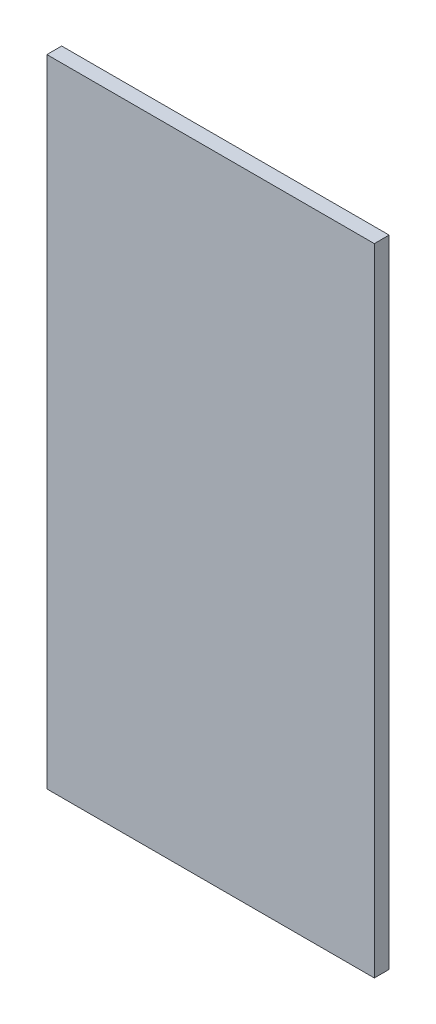
ISO-10303-21;
HEADER;
FILE_DESCRIPTION(('STEP AP214'),'2;1');
FILE_NAME('part.step','',(''),(''),'','','');
FILE_SCHEMA(('AUTOMOTIVE_DESIGN { 1 0 10303 214 1 1 1 1 }'));
ENDSEC;
DATA;
#1=APPLICATION_CONTEXT('core data for automotive mechanical design processes');
#2=APPLICATION_PROTOCOL_DEFINITION('international standard','automotive_design',2000,#1);
#3=PRODUCT_CONTEXT('',#1,'mechanical');
#4=PRODUCT('Part','Part','',(#3));
#5=PRODUCT_RELATED_PRODUCT_CATEGORY('part','',(#4));
#6=PRODUCT_DEFINITION_FORMATION('','',#4);
#7=PRODUCT_DEFINITION_CONTEXT('part definition',#1,'design');
#8=PRODUCT_DEFINITION('design','',#6,#7);
#9=PRODUCT_DEFINITION_SHAPE('','',#8);
#10=(LENGTH_UNIT() NAMED_UNIT(*) SI_UNIT(.MILLI.,.METRE.));
#11=(NAMED_UNIT(*) PLANE_ANGLE_UNIT() SI_UNIT($,.RADIAN.));
#12=(NAMED_UNIT(*) SI_UNIT($,.STERADIAN.) SOLID_ANGLE_UNIT());
#13=UNCERTAINTY_MEASURE_WITH_UNIT(LENGTH_MEASURE(1.E-05),#10,'distance_accuracy_value','');
#14=(GEOMETRIC_REPRESENTATION_CONTEXT(3) GLOBAL_UNCERTAINTY_ASSIGNED_CONTEXT((#13)) GLOBAL_UNIT_ASSIGNED_CONTEXT((#10,
#11,#12)) REPRESENTATION_CONTEXT('',''));
#15=CARTESIAN_POINT('',(0.,0.,0.));
#16=DIRECTION('',(0.,0.,1.));
#17=DIRECTION('',(1.,0.,0.));
#18=AXIS2_PLACEMENT_3D('',#15,#16,#17);
#19=CARTESIAN_POINT('',(-199.,-386.5,18.));
#20=DIRECTION('',(1.,0.,0.));
#21=DIRECTION('',(0.,0.,-1.));
#22=AXIS2_PLACEMENT_3D('',#19,#20,#21);
#23=PLANE('',#22);
#24=DIRECTION('',(0.,-1.,0.));
#25=VECTOR('',#24,1.);
#26=CARTESIAN_POINT('',(-199.,-386.5,0.));
#27=LINE('',#26,#25);
#28=CARTESIAN_POINT('',(-199.,386.5,0.));
#29=VERTEX_POINT('',#28);
#30=CARTESIAN_POINT('',(-199.,-386.5,0.));
#31=VERTEX_POINT('',#30);
#32=EDGE_CURVE('E95',#29,#31,#27,.T.);
#33=ORIENTED_EDGE('',*,*,#32,.T.);
#34=DIRECTION('',(0.,0.,-1.));
#35=VECTOR('',#34,1.);
#36=CARTESIAN_POINT('',(-199.,-386.5,18.));
#37=LINE('',#36,#35);
#38=CARTESIAN_POINT('',(-199.,-386.5,18.));
#39=VERTEX_POINT('',#38);
#40=EDGE_CURVE('E11',#39,#31,#37,.T.);
#41=ORIENTED_EDGE('',*,*,#40,.F.);
#42=DIRECTION('',(0.,-1.,0.));
#43=VECTOR('',#42,1.);
#44=CARTESIAN_POINT('',(-199.,-386.5,18.));
#45=LINE('',#44,#43);
#46=CARTESIAN_POINT('',(-199.,386.5,18.));
#47=VERTEX_POINT('',#46);
#48=EDGE_CURVE('E83',#47,#39,#45,.T.);
#49=ORIENTED_EDGE('',*,*,#48,.F.);
#50=DIRECTION('',(0.,0.,-1.));
#51=VECTOR('',#50,1.);
#52=CARTESIAN_POINT('',(-199.,386.5,18.));
#53=LINE('',#52,#51);
#54=EDGE_CURVE('E91',#47,#29,#53,.T.);
#55=ORIENTED_EDGE('',*,*,#54,.T.);
#56=EDGE_LOOP('',(#33,#41,#49,#55));
#57=FACE_BOUND('',#56,.T.);
#58=ADVANCED_FACE('F32',(#57),#23,.F.);
#59=CARTESIAN_POINT('',(199.,-386.5,18.));
#60=DIRECTION('',(0.,1.,0.));
#61=DIRECTION('',(-1.,0.,0.));
#62=AXIS2_PLACEMENT_3D('',#59,#60,#61);
#63=PLANE('',#62);
#64=DIRECTION('',(1.,0.,0.));
#65=VECTOR('',#64,1.);
#66=CARTESIAN_POINT('',(199.,-386.5,0.));
#67=LINE('',#66,#65);
#68=CARTESIAN_POINT('',(199.,-386.5,0.));
#69=VERTEX_POINT('',#68);
#70=EDGE_CURVE('E87',#31,#69,#67,.T.);
#71=ORIENTED_EDGE('',*,*,#70,.T.);
#72=DIRECTION('',(0.,0.,-1.));
#73=VECTOR('',#72,1.);
#74=CARTESIAN_POINT('',(199.,-386.5,18.));
#75=LINE('',#74,#73);
#76=CARTESIAN_POINT('',(199.,-386.5,18.));
#77=VERTEX_POINT('',#76);
#78=EDGE_CURVE('E40',#77,#69,#75,.T.);
#79=ORIENTED_EDGE('',*,*,#78,.F.);
#80=DIRECTION('',(1.,0.,0.));
#81=VECTOR('',#80,1.);
#82=CARTESIAN_POINT('',(199.,-386.5,18.));
#83=LINE('',#82,#81);
#84=EDGE_CURVE('E78',#39,#77,#83,.T.);
#85=ORIENTED_EDGE('',*,*,#84,.F.);
#86=ORIENTED_EDGE('',*,*,#40,.T.);
#87=EDGE_LOOP('',(#71,#79,#85,#86));
#88=FACE_BOUND('',#87,.T.);
#89=ADVANCED_FACE('F86',(#88),#63,.F.);
#90=CARTESIAN_POINT('',(199.,-386.5,18.));
#91=DIRECTION('',(-1.,0.,0.));
#92=DIRECTION('',(0.,0.,1.));
#93=AXIS2_PLACEMENT_3D('',#90,#91,#92);
#94=PLANE('',#93);
#95=DIRECTION('',(0.,1.,0.));
#96=VECTOR('',#95,1.);
#97=CARTESIAN_POINT('',(199.,-386.5,0.));
#98=LINE('',#97,#96);
#99=CARTESIAN_POINT('',(199.,386.5,0.));
#100=VERTEX_POINT('',#99);
#101=EDGE_CURVE('E65',#69,#100,#98,.T.);
#102=ORIENTED_EDGE('',*,*,#101,.T.);
#103=DIRECTION('',(0.,0.,-1.));
#104=VECTOR('',#103,1.);
#105=CARTESIAN_POINT('',(199.,386.5,18.));
#106=LINE('',#105,#104);
#107=CARTESIAN_POINT('',(199.,386.5,18.));
#108=VERTEX_POINT('',#107);
#109=EDGE_CURVE('E88',#108,#100,#106,.T.);
#110=ORIENTED_EDGE('',*,*,#109,.F.);
#111=DIRECTION('',(0.,1.,0.));
#112=VECTOR('',#111,1.);
#113=CARTESIAN_POINT('',(199.,-386.5,18.));
#114=LINE('',#113,#112);
#115=EDGE_CURVE('E81',#77,#108,#114,.T.);
#116=ORIENTED_EDGE('',*,*,#115,.F.);
#117=ORIENTED_EDGE('',*,*,#78,.T.);
#118=EDGE_LOOP('',(#102,#110,#116,#117));
#119=FACE_BOUND('',#118,.T.);
#120=ADVANCED_FACE('F89',(#119),#94,.F.);
#121=CARTESIAN_POINT('',(199.,386.5,18.));
#122=DIRECTION('',(0.,-1.,0.));
#123=DIRECTION('',(1.,0.,0.));
#124=AXIS2_PLACEMENT_3D('',#121,#122,#123);
#125=PLANE('',#124);
#126=DIRECTION('',(-1.,0.,0.));
#127=VECTOR('',#126,1.);
#128=CARTESIAN_POINT('',(199.,386.5,0.));
#129=LINE('',#128,#127);
#130=EDGE_CURVE('E71',#100,#29,#129,.T.);
#131=ORIENTED_EDGE('',*,*,#130,.T.);
#132=ORIENTED_EDGE('',*,*,#54,.F.);
#133=DIRECTION('',(-1.,0.,0.));
#134=VECTOR('',#133,1.);
#135=CARTESIAN_POINT('',(199.,386.5,18.));
#136=LINE('',#135,#134);
#137=EDGE_CURVE('E48',#108,#47,#136,.T.);
#138=ORIENTED_EDGE('',*,*,#137,.F.);
#139=ORIENTED_EDGE('',*,*,#109,.T.);
#140=EDGE_LOOP('',(#131,#132,#138,#139));
#141=FACE_BOUND('',#140,.T.);
#142=ADVANCED_FACE('F102',(#141),#125,.F.);
#143=CARTESIAN_POINT('',(0.,0.,18.));
#144=DIRECTION('',(0.,0.,1.));
#145=DIRECTION('',(1.,0.,0.));
#146=AXIS2_PLACEMENT_3D('',#143,#144,#145);
#147=PLANE('',#146);
#148=ORIENTED_EDGE('',*,*,#48,.T.);
#149=ORIENTED_EDGE('',*,*,#84,.T.);
#150=ORIENTED_EDGE('',*,*,#115,.T.);
#151=ORIENTED_EDGE('',*,*,#137,.T.);
#152=EDGE_LOOP('',(#148,#149,#150,#151));
#153=FACE_BOUND('',#152,.T.);
#154=ADVANCED_FACE('F79',(#153),#147,.T.);
#155=CARTESIAN_POINT('',(0.,0.,0.));
#156=DIRECTION('',(0.,0.,1.));
#157=DIRECTION('',(1.,0.,0.));
#158=AXIS2_PLACEMENT_3D('',#155,#156,#157);
#159=PLANE('',#158);
#160=ORIENTED_EDGE('',*,*,#32,.F.);
#161=ORIENTED_EDGE('',*,*,#130,.F.);
#162=ORIENTED_EDGE('',*,*,#101,.F.);
#163=ORIENTED_EDGE('',*,*,#70,.F.);
#164=EDGE_LOOP('',(#160,#161,#162,#163));
#165=FACE_BOUND('',#164,.T.);
#166=ADVANCED_FACE('F105',(#165),#159,.F.);
#167=CLOSED_SHELL('',(#58,#89,#120,#142,#154,#166));
#168=MANIFOLD_SOLID_BREP('B2',#167);
#169=ADVANCED_BREP_SHAPE_REPRESENTATION('',(#18,#168),#14);
#170=SHAPE_DEFINITION_REPRESENTATION(#9,#169);
ENDSEC;
END-ISO-10303-21;
